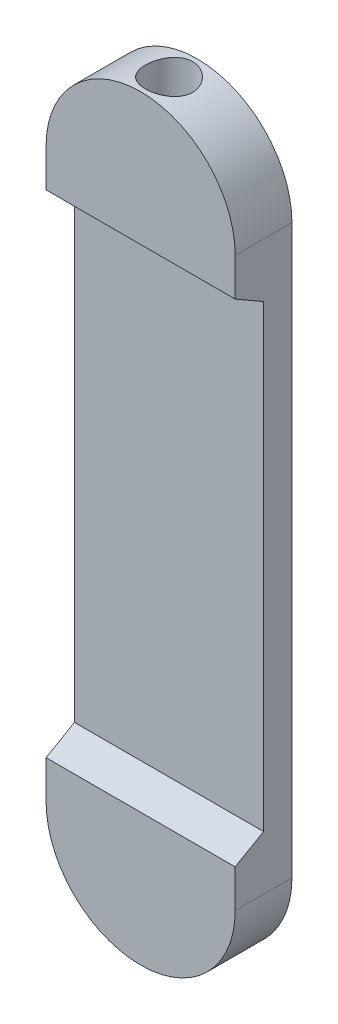
ISO-10303-21;
HEADER;
FILE_DESCRIPTION(('STEP AP214'),'2;1');
FILE_NAME('part.step','',(''),(''),'','','');
FILE_SCHEMA(('AUTOMOTIVE_DESIGN { 1 0 10303 214 1 1 1 1 }'));
ENDSEC;
DATA;
#1=APPLICATION_CONTEXT('core data for automotive mechanical design processes');
#2=APPLICATION_PROTOCOL_DEFINITION('international standard','automotive_design',2000,#1);
#3=PRODUCT_CONTEXT('',#1,'mechanical');
#4=PRODUCT('Part','Part','',(#3));
#5=PRODUCT_RELATED_PRODUCT_CATEGORY('part','',(#4));
#6=PRODUCT_DEFINITION_FORMATION('','',#4);
#7=PRODUCT_DEFINITION_CONTEXT('part definition',#1,'design');
#8=PRODUCT_DEFINITION('design','',#6,#7);
#9=PRODUCT_DEFINITION_SHAPE('','',#8);
#10=(LENGTH_UNIT() NAMED_UNIT(*) SI_UNIT(.MILLI.,.METRE.));
#11=(NAMED_UNIT(*) PLANE_ANGLE_UNIT() SI_UNIT($,.RADIAN.));
#12=(NAMED_UNIT(*) SI_UNIT($,.STERADIAN.) SOLID_ANGLE_UNIT());
#13=UNCERTAINTY_MEASURE_WITH_UNIT(LENGTH_MEASURE(1.E-05),#10,'distance_accuracy_value','');
#14=(GEOMETRIC_REPRESENTATION_CONTEXT(3) GLOBAL_UNCERTAINTY_ASSIGNED_CONTEXT((#13)) GLOBAL_UNIT_ASSIGNED_CONTEXT((#10,
#11,#12)) REPRESENTATION_CONTEXT('',''));
#15=CARTESIAN_POINT('',(0.,0.,0.));
#16=DIRECTION('',(0.,0.,1.));
#17=DIRECTION('',(1.,0.,0.));
#18=AXIS2_PLACEMENT_3D('',#15,#16,#17);
#19=CARTESIAN_POINT('',(0.,150.,15.));
#20=DIRECTION('',(0.,0.,1.));
#21=DIRECTION('',(1.,0.,0.));
#22=AXIS2_PLACEMENT_3D('',#19,#20,#21);
#23=PLANE('',#22);
#24=DIRECTION('',(-1.,0.,0.));
#25=VECTOR('',#24,1.);
#26=CARTESIAN_POINT('',(0.,130.,15.));
#27=LINE('',#26,#25);
#28=CARTESIAN_POINT('',(50.,130.,15.));
#29=VERTEX_POINT('',#28);
#30=CARTESIAN_POINT('',(-50.,130.,15.));
#31=VERTEX_POINT('',#30);
#32=EDGE_CURVE('E11',#29,#31,#27,.T.);
#33=ORIENTED_EDGE('',*,*,#32,.F.);
#34=DIRECTION('',(0.,1.,0.));
#35=VECTOR('',#34,1.);
#36=CARTESIAN_POINT('',(50.,-150.,15.));
#37=LINE('',#36,#35);
#38=CARTESIAN_POINT('',(50.,150.,15.));
#39=VERTEX_POINT('',#38);
#40=EDGE_CURVE('E77',#29,#39,#37,.T.);
#41=ORIENTED_EDGE('',*,*,#40,.T.);
#42=CARTESIAN_POINT('',(0.,150.,15.));
#43=DIRECTION('',(0.,0.,1.));
#44=DIRECTION('',(1.,0.,0.));
#45=AXIS2_PLACEMENT_3D('',#42,#43,#44);
#46=CIRCLE('',#45,50.);
#47=CARTESIAN_POINT('',(-50.,150.,15.));
#48=VERTEX_POINT('',#47);
#49=EDGE_CURVE('E172',#39,#48,#46,.T.);
#50=ORIENTED_EDGE('',*,*,#49,.T.);
#51=DIRECTION('',(0.,-1.,0.));
#52=VECTOR('',#51,1.);
#53=CARTESIAN_POINT('',(-50.,-150.,15.));
#54=LINE('',#53,#52);
#55=EDGE_CURVE('E107',#48,#31,#54,.T.);
#56=ORIENTED_EDGE('',*,*,#55,.T.);
#57=EDGE_LOOP('',(#33,#41,#50,#56));
#58=FACE_BOUND('',#57,.T.);
#59=ADVANCED_FACE('F45',(#58),#23,.T.);
#60=CARTESIAN_POINT('',(0.,150.,15.));
#61=DIRECTION('',(0.,0.,-1.));
#62=DIRECTION('',(-1.,0.,0.));
#63=AXIS2_PLACEMENT_3D('',#60,#61,#62);
#64=CYLINDRICAL_SURFACE('',#63,50.);
#65=CARTESIAN_POINT('',(0.,150.,-15.));
#66=DIRECTION('',(0.,0.,1.));
#67=DIRECTION('',(1.,0.,0.));
#68=AXIS2_PLACEMENT_3D('',#65,#66,#67);
#69=CIRCLE('',#68,50.);
#70=CARTESIAN_POINT('',(50.,150.,-15.));
#71=VERTEX_POINT('',#70);
#72=CARTESIAN_POINT('',(-50.,150.,-15.));
#73=VERTEX_POINT('',#72);
#74=EDGE_CURVE('E160',#71,#73,#69,.T.);
#75=ORIENTED_EDGE('',*,*,#74,.T.);
#76=DIRECTION('',(0.,0.,-1.));
#77=VECTOR('',#76,1.);
#78=CARTESIAN_POINT('',(-50.,150.,15.));
#79=LINE('',#78,#77);
#80=EDGE_CURVE('E136',#48,#73,#79,.T.);
#81=ORIENTED_EDGE('',*,*,#80,.F.);
#82=ORIENTED_EDGE('',*,*,#49,.F.);
#83=DIRECTION('',(0.,0.,-1.));
#84=VECTOR('',#83,1.);
#85=CARTESIAN_POINT('',(50.,150.,15.));
#86=LINE('',#85,#84);
#87=EDGE_CURVE('E151',#39,#71,#86,.T.);
#88=ORIENTED_EDGE('',*,*,#87,.T.);
#89=EDGE_LOOP('',(#75,#81,#82,#88));
#90=FACE_BOUND('',#89,.T.);
#91=CARTESIAN_POINT('',(0.,200.,-12.5));
#92=CARTESIAN_POINT('',(-0.345345858129955,199.999999184285,-12.499998542476));
#93=CARTESIAN_POINT('',(-0.690720980627794,199.996413178085,-12.4856762712683));
#94=CARTESIAN_POINT('',(-1.37897685436808,199.982166282124,-12.4285034438653));
#95=CARTESIAN_POINT('',(-1.7218573165034,199.971504585157,-12.3856496327458));
#96=CARTESIAN_POINT('',(-2.40280021913144,199.943395206291,-12.2717468283778));
#97=CARTESIAN_POINT('',(-2.74086012527902,199.925944082084,-12.2006835322718));
#98=CARTESIAN_POINT('',(-3.40956959119171,199.884737782645,-12.0309531087511));
#99=CARTESIAN_POINT('',(-3.74021934014551,199.860982768556,-11.932286686941));
#100=CARTESIAN_POINT('',(-4.39143160454447,199.807850138443,-11.7082770348339));
#101=CARTESIAN_POINT('',(-4.71200589293533,199.778479392052,-11.5829663772143));
#102=CARTESIAN_POINT('',(-5.34133409076771,199.714889005911,-11.3065586325392));
#103=CARTESIAN_POINT('',(-5.65008793760106,199.680669340483,-11.1554614089257));
#104=CARTESIAN_POINT('',(-6.25375145648697,199.608295845489,-10.8285920771972));
#105=CARTESIAN_POINT('',(-6.54866132890482,199.570142072887,-10.6528203263462));
#106=CARTESIAN_POINT('',(-7.1227706440562,199.49090954588,-10.2778258129714));
#107=CARTESIAN_POINT('',(-7.40196939376919,199.449830662629,-10.0786020171701));
#108=CARTESIAN_POINT('',(-7.94789184610699,199.365055796241,-9.65415754429416));
#109=CARTESIAN_POINT('',(-8.21428968409248,199.321325479097,-9.42852450106898));
#110=CARTESIAN_POINT('',(-8.7272289784513,199.23315156486,-8.95584237426211));
#111=CARTESIAN_POINT('',(-8.97377020011485,199.188707959344,-8.70879303760656));
#112=CARTESIAN_POINT('',(-9.44541093088348,199.100323812197,-8.19486829551773));
#113=CARTESIAN_POINT('',(-9.67050778077715,199.056383333549,-7.92799043853143));
#114=CARTESIAN_POINT('',(-10.097711498905,198.970232983262,-7.37617587363528));
#115=CARTESIAN_POINT('',(-10.2998189613326,198.928023066912,-7.09123963276649));
#116=CARTESIAN_POINT('',(-10.6824846765056,198.845914886664,-6.50077864948295));
#117=CARTESIAN_POINT('',(-10.8626766877929,198.806060474744,-6.19501027061268));
#118=CARTESIAN_POINT('',(-11.1965999199108,198.730539402161,-5.56884605054303));
#119=CARTESIAN_POINT('',(-11.3503308067052,198.694872794366,-5.24845002475386));
#120=CARTESIAN_POINT('',(-11.6301059024363,198.628811520673,-4.59530579606809));
#121=CARTESIAN_POINT('',(-11.7561535554537,198.598416199073,-4.26255913574648));
#122=CARTESIAN_POINT('',(-11.9795435842076,198.543833524198,-3.58707023733103));
#123=CARTESIAN_POINT('',(-12.0768866475326,198.519646022224,-3.24432823888126));
#124=CARTESIAN_POINT('',(-12.2403753433022,198.478656911185,-2.55832805448346));
#125=CARTESIAN_POINT('',(-12.3071067781999,198.461717073307,-2.21521770157624));
#126=CARTESIAN_POINT('',(-12.4116255097281,198.435054152996,-1.52433762999712));
#127=CARTESIAN_POINT('',(-12.4494131572523,198.425330983075,-1.17656796786334));
#128=CARTESIAN_POINT('',(-12.4957081162939,198.413405711739,-0.479005845104437));
#129=CARTESIAN_POINT('',(-12.5042195850568,198.411202542477,-0.129213678743619));
#130=CARTESIAN_POINT('',(-12.4918975051369,198.414383592704,0.56981600901988));
#131=CARTESIAN_POINT('',(-12.4710643644883,198.419767706692,0.919053538067147));
#132=CARTESIAN_POINT('',(-12.4011011342675,198.437732699288,1.60591279143432));
#133=CARTESIAN_POINT('',(-12.3526702834176,198.45013569001,1.94361068244322));
#134=CARTESIAN_POINT('',(-12.2284550484748,198.481635558749,2.61361187278367));
#135=CARTESIAN_POINT('',(-12.1526711732496,198.500732312238,2.94591527235263));
#136=CARTESIAN_POINT('',(-11.9743582368255,198.545063330048,3.60285956314226));
#137=CARTESIAN_POINT('',(-11.8718278701608,198.570297893945,3.92750007950268));
#138=CARTESIAN_POINT('',(-11.6408201249125,198.62618035636,4.56693246540194));
#139=CARTESIAN_POINT('',(-11.5123423376766,198.656828340134,4.8817241797394));
#140=CARTESIAN_POINT('',(-11.2289731703879,198.723008232122,5.50252257587502));
#141=CARTESIAN_POINT('',(-11.0738287052328,198.75858623661,5.80840878938925));
#142=CARTESIAN_POINT('',(-10.7391618403495,198.833388041298,6.4060680089994));
#143=CARTESIAN_POINT('',(-10.5596393506019,198.872611854959,6.69784096297475));
#144=CARTESIAN_POINT('',(-10.1774241513362,198.953633076933,7.26547516607328));
#145=CARTESIAN_POINT('',(-9.97472805748094,198.995430860742,7.54133408219258));
#146=CARTESIAN_POINT('',(-9.54752439698663,199.080466581578,8.07537681044579));
#147=CARTESIAN_POINT('',(-9.32301640852999,199.123704546445,8.33356028059175));
#148=CARTESIAN_POINT('',(-8.84692110492471,199.211708281983,8.83773744641804));
#149=CARTESIAN_POINT('',(-8.59474378950227,199.256482435885,9.08317289987926));
#150=CARTESIAN_POINT('',(-8.07050421758106,199.345087069182,9.551995703129));
#151=CARTESIAN_POINT('',(-7.79844157272413,199.388917530125,9.77538262211187));
#152=CARTESIAN_POINT('',(-7.23621606208977,199.474417786311,10.1985771706933));
#153=CARTESIAN_POINT('',(-6.94605248845918,199.51608749694,10.3983838772818));
#154=CARTESIAN_POINT('',(-6.34956444270317,199.596104338477,10.772978157784));
#155=CARTESIAN_POINT('',(-6.04324006914541,199.634451489647,10.947765884269));
#156=CARTESIAN_POINT('',(-5.41541235056755,199.706875689934,11.2715789798304));
#157=CARTESIAN_POINT('',(-5.09386005140018,199.740937469953,11.4205129077416));
#158=CARTESIAN_POINT('',(-4.43881192206135,199.803666427227,11.6907000644577));
#159=CARTESIAN_POINT('',(-4.10531602480211,199.832333574175,11.8119531377496));
#160=CARTESIAN_POINT('',(-3.42883552948264,199.883445320008,12.0257598474396));
#161=CARTESIAN_POINT('',(-3.08585241729649,199.905890887307,12.1183179505915));
#162=CARTESIAN_POINT('',(-2.39289058593558,199.943913194151,12.2739631052046));
#163=CARTESIAN_POINT('',(-2.04291203945214,199.959490103039,12.3370508832442));
#164=CARTESIAN_POINT('',(-1.34763092374324,199.983014865086,12.4319680906689));
#165=CARTESIAN_POINT('',(-1.00243806174491,199.991147839537,12.4645564950301));
#166=CARTESIAN_POINT('',(-0.310446227793136,200.000233463267,12.5009464008154));
#167=CARTESIAN_POINT('',(0.0363527166592404,200.001186235042,12.5047483933412));
#168=CARTESIAN_POINT('',(0.728982210807774,199.995885034322,12.4835341096494));
#169=CARTESIAN_POINT('',(1.07481283841245,199.989631659355,12.458520222818));
#170=CARTESIAN_POINT('',(1.76300446713083,199.970094195313,12.3798934330572));
#171=CARTESIAN_POINT('',(2.10536548180506,199.956810133729,12.3262806419468));
#172=CARTESIAN_POINT('',(2.77909750176338,199.923828862721,12.1919176524651));
#173=CARTESIAN_POINT('',(3.11055621416769,199.90422984941,12.1115824000743));
#174=CARTESIAN_POINT('',(3.76542622915844,199.859094400732,11.9242422256603));
#175=CARTESIAN_POINT('',(4.08883763558724,199.833558042024,11.8172376479743));
#176=CARTESIAN_POINT('',(4.72547495684811,199.777223972746,11.5773748413572));
#177=CARTESIAN_POINT('',(5.03870011901851,199.746425874434,11.4445147070017));
#178=CARTESIAN_POINT('',(5.65290579173548,199.680379178579,11.1539268996522));
#179=CARTESIAN_POINT('',(5.95388607609178,199.645130498873,10.996198767553));
#180=CARTESIAN_POINT('',(6.54690733138469,199.57044384345,10.6539790694276));
#181=CARTESIAN_POINT('',(6.83869503605042,199.530942648331,10.4690623992547));
#182=CARTESIAN_POINT('',(7.40573208883361,199.449339710756,10.075919856371));
#183=CARTESIAN_POINT('',(7.68098127638992,199.407237943061,9.86769375742107));
#184=CARTESIAN_POINT('',(8.21323439402229,199.321551719819,9.42929844928364));
#185=CARTESIAN_POINT('',(8.47023554350212,199.277967039799,9.19912590841093));
#186=CARTESIAN_POINT('',(8.96431645792167,199.190486774203,8.71836265750537));
#187=CARTESIAN_POINT('',(9.20139599740279,199.146591185113,8.46777171645481));
#188=CARTESIAN_POINT('',(9.65967669367524,199.058602006003,7.94137233363743));
#189=CARTESIAN_POINT('',(9.8803443006733,199.014530071314,7.66509543686493));
#190=CARTESIAN_POINT('',(10.2976362133889,198.928561070308,7.09461670037542));
#191=CARTESIAN_POINT('',(10.494260080341,198.886664043689,6.8004145336935));
#192=CARTESIAN_POINT('',(10.8620404955946,198.806265209162,6.19606290103677));
#193=CARTESIAN_POINT('',(11.0331976403887,198.76776332174,5.88591380880689));
#194=CARTESIAN_POINT('',(11.3487546890229,198.69529742399,5.25177939598629));
#195=CARTESIAN_POINT('',(11.493154965098,198.661333350535,4.92779426795627));
#196=CARTESIAN_POINT('',(11.7532704940522,198.599160704575,4.27023312528235));
#197=CARTESIAN_POINT('',(11.8691526557657,198.570918822345,3.93672631797506));
#198=CARTESIAN_POINT('',(12.0723939041458,198.520802494786,3.26065850705787));
#199=CARTESIAN_POINT('',(12.1597530307871,198.498928040534,2.91809751613803));
#200=CARTESIAN_POINT('',(12.3051825749983,198.462233904861,2.22650410200566));
#201=CARTESIAN_POINT('',(12.363258366872,198.44741292896,1.87747287845977));
#202=CARTESIAN_POINT('',(12.4496272042819,198.425290706484,1.17551084786422));
#203=CARTESIAN_POINT('',(12.4779209663603,198.417989278992,0.822580134840997));
#204=CARTESIAN_POINT('',(12.5040902755747,198.411237274818,0.125690563470849));
#205=CARTESIAN_POINT('',(12.5028170258756,198.411567004214,-0.218234490431433));
#206=CARTESIAN_POINT('',(12.4719496530419,198.419528359508,-0.904721133720526));
#207=CARTESIAN_POINT('',(12.4423561029709,198.427159837655,-1.24728275055576));
#208=CARTESIAN_POINT('',(12.3551031042829,198.449493783664,-1.92856624844878));
#209=CARTESIAN_POINT('',(12.2974444019395,198.464196063509,-2.26728823136027));
#210=CARTESIAN_POINT('',(12.1545443869924,198.500231662698,-2.93850126361318));
#211=CARTESIAN_POINT('',(12.0693029361175,198.521565015284,-3.27099228171019));
#212=CARTESIAN_POINT('',(11.872520891633,198.570087933544,-3.92547045749319));
#213=CARTESIAN_POINT('',(11.7611408263901,198.597241668922,-4.24750858869968));
#214=CARTESIAN_POINT('',(11.512668480082,198.656703240108,-4.88100719240879));
#215=CARTESIAN_POINT('',(11.3755763832328,198.689011038988,-5.19246774067647));
#216=CARTESIAN_POINT('',(11.0766699521319,198.75788031468,-5.80283282354661));
#217=CARTESIAN_POINT('',(10.9148532284252,198.794442202535,-6.10173614102079));
#218=CARTESIAN_POINT('',(10.5676324058471,198.870816774177,-6.6850856288295));
#219=CARTESIAN_POINT('',(10.3822273342624,198.910629591997,-6.96953120229243));
#220=CARTESIAN_POINT('',(9.98393796386294,198.993503812733,-7.52941321165711));
#221=CARTESIAN_POINT('',(9.77046302819968,199.036622864994,-7.80442110523205));
#222=CARTESIAN_POINT('',(9.32142482529095,199.123958929279,-8.33558565405774));
#223=CARTESIAN_POINT('',(9.08586116383034,199.168175960887,-8.59174197272077));
#224=CARTESIAN_POINT('',(8.59419030433725,199.256494625742,-9.08354529744731));
#225=CARTESIAN_POINT('',(8.33808285097161,199.300596257546,-9.31919204852711));
#226=CARTESIAN_POINT('',(7.80686919956303,199.387500913739,-9.76851402919657));
#227=CARTESIAN_POINT('',(7.53175479311294,199.430303365428,-9.98217966554262));
#228=CARTESIAN_POINT('',(6.95924298273734,199.514181118891,-10.3896396759224));
#229=CARTESIAN_POINT('',(6.66153155922842,199.55521091619,-10.5830025235865));
#230=CARTESIAN_POINT('',(6.0505082327496,199.633518505882,-10.943818987176));
#231=CARTESIAN_POINT('',(5.73720336100236,199.67079796683,-11.1112841431721));
#232=CARTESIAN_POINT('',(5.09716652663357,199.740551632484,-11.4190604869767));
#233=CARTESIAN_POINT('',(4.77043989044131,199.773027720314,-11.5593823227875));
#234=CARTESIAN_POINT('',(4.10578919609509,199.832256061333,-11.8118084302427));
#235=CARTESIAN_POINT('',(3.76786683581591,199.859009177884,-11.9239169585779));
#236=CARTESIAN_POINT('',(3.14787089764562,199.901587879739,-12.1005925818354));
#237=CARTESIAN_POINT('',(2.86728001520346,199.918522742067,-12.1701379933195));
#238=CARTESIAN_POINT('',(2.3017294789982,199.947794606943,-12.2896522930125));
#239=CARTESIAN_POINT('',(2.01677013144287,199.960131930235,-12.339622546882));
#240=CARTESIAN_POINT('',(1.44387788843724,199.979969707119,-12.4196972192842));
#241=CARTESIAN_POINT('',(1.15594470933018,199.987469694893,-12.4497997246361));
#242=CARTESIAN_POINT('',(0.578680949140913,199.997484542333,-12.4899491478882));
#243=CARTESIAN_POINT('',(0.289350746448697,200.000000683453,-12.500001221198));
#244=CARTESIAN_POINT('',(0.,200.,-12.5));
#245=B_SPLINE_CURVE_WITH_KNOTS('',3,(#91,#92,#93,#94,#95,#96,#97,#98,#99,#100,#101,#102,#103,
#104,#105,#106,#107,#108,#109,#110,#111,#112,#113,#114,#115,#116,#117,#118,#119,#120,#121,#122,
#123,#124,#125,#126,#127,#128,#129,#130,#131,#132,#133,#134,#135,#136,#137,#138,#139,#140,#141,
#142,#143,#144,#145,#146,#147,#148,#149,#150,#151,#152,#153,#154,#155,#156,#157,#158,#159,#160,
#161,#162,#163,#164,#165,#166,#167,#168,#169,#170,#171,#172,#173,#174,#175,#176,#177,#178,#179,
#180,#181,#182,#183,#184,#185,#186,#187,#188,#189,#190,#191,#192,#193,#194,#195,#196,#197,#198,
#199,#200,#201,#202,#203,#204,#205,#206,#207,#208,#209,#210,#211,#212,#213,#214,#215,#216,#217,
#218,#219,#220,#221,#222,#223,#224,#225,#226,#227,#228,#229,#230,#231,#232,#233,#234,#235,#236,
#237,#238,#239,#240,#241,#242,#243,#244),.UNSPECIFIED.,.T.,.F.,(4,2,2,2,2,2,2,2,2,2,2,2,2,2,2,2,
2,2,2,2,2,2,2,2,2,2,2,2,2,2,2,2,2,2,2,2,2,2,2,2,2,2,2,2,2,2,2,2,2,2,2,2,2,2,2,2,2,2,2,2,2,2,2,2,
2,2,2,2,2,2,2,2,2,2,2,2,4),(0.,1.03577386168253,2.0716659063673,3.10808384435616,
4.1444752913513,5.17960695669381,6.21474410395866,7.24986626495346,8.2850340496454,
9.3393306674218,10.3936397453979,11.4480793933577,12.5024917816352,13.5726259410068,
14.6427736083933,15.7127880628206,16.7827768840836,17.8313349253048,18.879880254364,
19.928276682827,20.97665853357,21.9995889895184,23.0225004161404,24.0454617792483,
25.0684392544812,26.1017236302133,27.1350118215961,28.1684511104691,29.2019103888785,
30.2648664166191,31.3278432093162,32.3908615967694,33.4538735014281,34.520571739592,
35.5872759703926,36.6538140710205,37.7203258752158,38.7595309263662,39.7987182484387,
40.8378194082581,41.8769165053203,42.9005782126277,43.9242267037567,44.9479506612139,
45.9716935205623,47.0135955987419,48.0555077904033,49.0975784071608,50.1396608157438,
51.2073584154887,52.2750754963473,53.3427675647283,54.4104447785245,55.4717160437128,
56.5329858215357,57.5940607559717,58.6551101608368,59.6856519612318,60.7161729089662,
61.7466664558696,62.7771651686731,63.8014935316577,64.8258145560391,65.8502346362694,
66.8746969742307,67.9258821743524,68.9770861384359,70.0283031696703,71.0799770556584,
72.1507569661663,73.2210583512334,74.2909390144763,75.3606581622632,76.22868967188,
77.0966606124975,77.9647151228769,78.8325464084547),.UNSPECIFIED.);
#246=CARTESIAN_POINT('',(0.,200.,-12.5));
#247=VERTEX_POINT('',#246);
#248=EDGE_CURVE('E165',#247,#247,#245,.T.);
#249=ORIENTED_EDGE('',*,*,#248,.F.);
#250=EDGE_LOOP('',(#249));
#251=FACE_BOUND('',#250,.T.);
#252=ADVANCED_FACE('F47',(#90,#251),#64,.T.);
#253=CARTESIAN_POINT('',(-50.,-150.,15.));
#254=DIRECTION('',(1.,0.,0.));
#255=DIRECTION('',(0.,0.,-1.));
#256=AXIS2_PLACEMENT_3D('',#253,#254,#255);
#257=PLANE('',#256);
#258=DIRECTION('',(0.,1.,0.));
#259=VECTOR('',#258,1.);
#260=CARTESIAN_POINT('',(-50.,-150.,0.));
#261=LINE('',#260,#259);
#262=CARTESIAN_POINT('',(-50.,-121.339745962156,0.));
#263=VERTEX_POINT('',#262);
#264=CARTESIAN_POINT('',(-50.,121.339745962156,0.));
#265=VERTEX_POINT('',#264);
#266=EDGE_CURVE('E235',#263,#265,#261,.T.);
#267=ORIENTED_EDGE('',*,*,#266,.T.);
#268=DIRECTION('',(0.,0.499999999999998,0.86602540378444));
#269=VECTOR('',#268,1.);
#270=CARTESIAN_POINT('',(-50.,60.0000000000007,-106.243556529821));
#271=LINE('',#270,#269);
#272=EDGE_CURVE('E238',#265,#31,#271,.T.);
#273=ORIENTED_EDGE('',*,*,#272,.T.);
#274=ORIENTED_EDGE('',*,*,#55,.F.);
#275=ORIENTED_EDGE('',*,*,#80,.T.);
#276=DIRECTION('',(0.,-1.,0.));
#277=VECTOR('',#276,1.);
#278=CARTESIAN_POINT('',(-50.,-150.,-15.));
#279=LINE('',#278,#277);
#280=CARTESIAN_POINT('',(-50.,-150.,-15.));
#281=VERTEX_POINT('',#280);
#282=EDGE_CURVE('E164',#73,#281,#279,.T.);
#283=ORIENTED_EDGE('',*,*,#282,.T.);
#284=DIRECTION('',(0.,0.,-1.));
#285=VECTOR('',#284,1.);
#286=CARTESIAN_POINT('',(-50.,-150.,15.));
#287=LINE('',#286,#285);
#288=CARTESIAN_POINT('',(-50.,-150.,15.));
#289=VERTEX_POINT('',#288);
#290=EDGE_CURVE('E176',#289,#281,#287,.T.);
#291=ORIENTED_EDGE('',*,*,#290,.F.);
#292=CARTESIAN_POINT('',(-50.,-130.,15.));
#293=VERTEX_POINT('',#292);
#294=EDGE_CURVE('E226',#293,#289,#54,.T.);
#295=ORIENTED_EDGE('',*,*,#294,.F.);
#296=DIRECTION('',(0.,0.499999999999998,-0.86602540378444));
#297=VECTOR('',#296,1.);
#298=CARTESIAN_POINT('',(-50.,-135.,23.6602540378444));
#299=LINE('',#298,#297);
#300=EDGE_CURVE('E68',#293,#263,#299,.T.);
#301=ORIENTED_EDGE('',*,*,#300,.T.);
#302=EDGE_LOOP('',(#267,#273,#274,#275,#283,#291,#295,#301));
#303=FACE_BOUND('',#302,.T.);
#304=ADVANCED_FACE('F207',(#303),#257,.F.);
#305=CARTESIAN_POINT('',(0.,-150.,15.));
#306=DIRECTION('',(0.,0.,-1.));
#307=DIRECTION('',(-1.,0.,0.));
#308=AXIS2_PLACEMENT_3D('',#305,#306,#307);
#309=CYLINDRICAL_SURFACE('',#308,50.);
#310=CARTESIAN_POINT('',(0.,-200.,12.5));
#311=CARTESIAN_POINT('',(0.345345858129954,-199.999999184285,12.499998542476));
#312=CARTESIAN_POINT('',(0.690720980627793,-199.996413178085,12.4856762712683));
#313=CARTESIAN_POINT('',(1.37897685436808,-199.982166282124,12.4285034438653));
#314=CARTESIAN_POINT('',(1.7218573165034,-199.971504585157,12.3856496327458));
#315=CARTESIAN_POINT('',(2.40280021913144,-199.943395206291,12.2717468283778));
#316=CARTESIAN_POINT('',(2.74086012527902,-199.925944082084,12.2006835322718));
#317=CARTESIAN_POINT('',(3.40956959119171,-199.884737782645,12.0309531087511));
#318=CARTESIAN_POINT('',(3.74021934014551,-199.860982768556,11.932286686941));
#319=CARTESIAN_POINT('',(4.39143160454447,-199.807850138443,11.7082770348339));
#320=CARTESIAN_POINT('',(4.71200589293533,-199.778479392052,11.5829663772143));
#321=CARTESIAN_POINT('',(5.34133409076771,-199.714889005911,11.3065586325392));
#322=CARTESIAN_POINT('',(5.65008793760106,-199.680669340483,11.1554614089257));
#323=CARTESIAN_POINT('',(6.25375145648697,-199.608295845489,10.8285920771972));
#324=CARTESIAN_POINT('',(6.54866132890482,-199.570142072887,10.6528203263462));
#325=CARTESIAN_POINT('',(7.1227706440562,-199.49090954588,10.2778258129714));
#326=CARTESIAN_POINT('',(7.40196939376919,-199.449830662629,10.0786020171701));
#327=CARTESIAN_POINT('',(7.94789184610699,-199.365055796241,9.65415754429416));
#328=CARTESIAN_POINT('',(8.21428968409248,-199.321325479097,9.42852450106898));
#329=CARTESIAN_POINT('',(8.7272289784513,-199.23315156486,8.95584237426211));
#330=CARTESIAN_POINT('',(8.97377020011485,-199.188707959344,8.70879303760655));
#331=CARTESIAN_POINT('',(9.44541093088348,-199.100323812197,8.19486829551772));
#332=CARTESIAN_POINT('',(9.67050778077715,-199.056383333549,7.92799043853142));
#333=CARTESIAN_POINT('',(10.097711498905,-198.970232983262,7.37617587363527));
#334=CARTESIAN_POINT('',(10.2998189613326,-198.928023066912,7.09123963276649));
#335=CARTESIAN_POINT('',(10.6824846765056,-198.845914886664,6.50077864948295));
#336=CARTESIAN_POINT('',(10.8626766877929,-198.806060474744,6.19501027061268));
#337=CARTESIAN_POINT('',(11.1965999199108,-198.730539402161,5.56884605054303));
#338=CARTESIAN_POINT('',(11.3503308067053,-198.694872794366,5.24845002475386));
#339=CARTESIAN_POINT('',(11.6301059024363,-198.628811520673,4.59530579606809));
#340=CARTESIAN_POINT('',(11.7561535554537,-198.598416199073,4.26255913574648));
#341=CARTESIAN_POINT('',(11.9795435842076,-198.543833524198,3.58707023733103));
#342=CARTESIAN_POINT('',(12.0768866475326,-198.519646022224,3.24432823888125));
#343=CARTESIAN_POINT('',(12.2403753433022,-198.478656911185,2.55832805448346));
#344=CARTESIAN_POINT('',(12.3071067781999,-198.461717073307,2.21521770157624));
#345=CARTESIAN_POINT('',(12.4116255097281,-198.435054152996,1.52433762999712));
#346=CARTESIAN_POINT('',(12.4494131572523,-198.425330983075,1.17656796786334));
#347=CARTESIAN_POINT('',(12.4957081162939,-198.413405711739,0.479005845104437));
#348=CARTESIAN_POINT('',(12.5042195850568,-198.411202542477,0.129213678743619));
#349=CARTESIAN_POINT('',(12.4918975051369,-198.414383592704,-0.56981600901988));
#350=CARTESIAN_POINT('',(12.4710643644883,-198.419767706692,-0.919053538067148));
#351=CARTESIAN_POINT('',(12.4011011342675,-198.437732699288,-1.60591279143433));
#352=CARTESIAN_POINT('',(12.3526702834176,-198.45013569001,-1.94361068244322));
#353=CARTESIAN_POINT('',(12.2284550484748,-198.481635558749,-2.61361187278367));
#354=CARTESIAN_POINT('',(12.1526711732496,-198.500732312238,-2.94591527235263));
#355=CARTESIAN_POINT('',(11.9743582368255,-198.545063330048,-3.60285956314227));
#356=CARTESIAN_POINT('',(11.8718278701608,-198.570297893945,-3.92750007950269));
#357=CARTESIAN_POINT('',(11.6408201249125,-198.62618035636,-4.56693246540194));
#358=CARTESIAN_POINT('',(11.5123423376766,-198.656828340134,-4.8817241797394));
#359=CARTESIAN_POINT('',(11.2289731703879,-198.723008232122,-5.50252257587503));
#360=CARTESIAN_POINT('',(11.0738287052328,-198.75858623661,-5.80840878938926));
#361=CARTESIAN_POINT('',(10.7391618403495,-198.833388041298,-6.40606800899941));
#362=CARTESIAN_POINT('',(10.5596393506019,-198.872611854959,-6.69784096297475));
#363=CARTESIAN_POINT('',(10.1774241513362,-198.953633076933,-7.26547516607329));
#364=CARTESIAN_POINT('',(9.97472805748094,-198.995430860742,-7.54133408219258));
#365=CARTESIAN_POINT('',(9.54752439698663,-199.080466581578,-8.07537681044579));
#366=CARTESIAN_POINT('',(9.32301640852998,-199.123704546445,-8.33356028059175));
#367=CARTESIAN_POINT('',(8.84692110492471,-199.211708281983,-8.83773744641804));
#368=CARTESIAN_POINT('',(8.59474378950227,-199.256482435885,-9.08317289987926));
#369=CARTESIAN_POINT('',(8.07050421758106,-199.345087069182,-9.551995703129));
#370=CARTESIAN_POINT('',(7.79844157272413,-199.388917530125,-9.77538262211187));
#371=CARTESIAN_POINT('',(7.23621606208977,-199.474417786311,-10.1985771706933));
#372=CARTESIAN_POINT('',(6.94605248845919,-199.51608749694,-10.3983838772818));
#373=CARTESIAN_POINT('',(6.34956444270317,-199.596104338477,-10.772978157784));
#374=CARTESIAN_POINT('',(6.04324006914541,-199.634451489647,-10.947765884269));
#375=CARTESIAN_POINT('',(5.41541235056755,-199.706875689934,-11.2715789798304));
#376=CARTESIAN_POINT('',(5.09386005140018,-199.740937469953,-11.4205129077416));
#377=CARTESIAN_POINT('',(4.43881192206135,-199.803666427227,-11.6907000644577));
#378=CARTESIAN_POINT('',(4.10531602480211,-199.832333574175,-11.8119531377496));
#379=CARTESIAN_POINT('',(3.42883552948264,-199.883445320008,-12.0257598474396));
#380=CARTESIAN_POINT('',(3.08585241729649,-199.905890887307,-12.1183179505915));
#381=CARTESIAN_POINT('',(2.39289058593557,-199.943913194151,-12.2739631052046));
#382=CARTESIAN_POINT('',(2.04291203945214,-199.959490103039,-12.3370508832442));
#383=CARTESIAN_POINT('',(1.34763092374324,-199.983014865086,-12.4319680906689));
#384=CARTESIAN_POINT('',(1.00243806174491,-199.991147839537,-12.4645564950301));
#385=CARTESIAN_POINT('',(0.310446227793134,-200.000233463267,-12.5009464008154));
#386=CARTESIAN_POINT('',(-0.0363527166592434,-200.001186235042,-12.5047483933412));
#387=CARTESIAN_POINT('',(-0.728982210807777,-199.995885034322,-12.4835341096494));
#388=CARTESIAN_POINT('',(-1.07481283841246,-199.989631659355,-12.458520222818));
#389=CARTESIAN_POINT('',(-1.76300446713084,-199.970094195313,-12.3798934330572));
#390=CARTESIAN_POINT('',(-2.10536548180507,-199.956810133729,-12.3262806419468));
#391=CARTESIAN_POINT('',(-2.77909750176338,-199.923828862721,-12.1919176524651));
#392=CARTESIAN_POINT('',(-3.11055621416769,-199.90422984941,-12.1115824000743));
#393=CARTESIAN_POINT('',(-3.76542622915844,-199.859094400732,-11.9242422256603));
#394=CARTESIAN_POINT('',(-4.08883763558724,-199.833558042024,-11.8172376479743));
#395=CARTESIAN_POINT('',(-4.72547495684811,-199.777223972746,-11.5773748413572));
#396=CARTESIAN_POINT('',(-5.03870011901852,-199.746425874434,-11.4445147070017));
#397=CARTESIAN_POINT('',(-5.65290579173548,-199.680379178579,-11.1539268996522));
#398=CARTESIAN_POINT('',(-5.95388607609178,-199.645130498873,-10.996198767553));
#399=CARTESIAN_POINT('',(-6.54690733138469,-199.57044384345,-10.6539790694276));
#400=CARTESIAN_POINT('',(-6.83869503605042,-199.530942648331,-10.4690623992547));
#401=CARTESIAN_POINT('',(-7.40573208883362,-199.449339710756,-10.075919856371));
#402=CARTESIAN_POINT('',(-7.68098127638992,-199.407237943061,-9.86769375742107));
#403=CARTESIAN_POINT('',(-8.21323439402229,-199.321551719819,-9.42929844928364));
#404=CARTESIAN_POINT('',(-8.47023554350212,-199.277967039799,-9.19912590841092));
#405=CARTESIAN_POINT('',(-8.96431645792168,-199.190486774203,-8.71836265750537));
#406=CARTESIAN_POINT('',(-9.2013959974028,-199.146591185113,-8.46777171645481));
#407=CARTESIAN_POINT('',(-9.65967669367525,-199.058602006003,-7.94137233363743));
#408=CARTESIAN_POINT('',(-9.8803443006733,-199.014530071314,-7.66509543686492));
#409=CARTESIAN_POINT('',(-10.2976362133889,-198.928561070308,-7.09461670037541));
#410=CARTESIAN_POINT('',(-10.494260080341,-198.886664043689,-6.80041453369349));
#411=CARTESIAN_POINT('',(-10.8620404955946,-198.806265209162,-6.19606290103676));
#412=CARTESIAN_POINT('',(-11.0331976403887,-198.76776332174,-5.88591380880689));
#413=CARTESIAN_POINT('',(-11.3487546890229,-198.69529742399,-5.25177939598629));
#414=CARTESIAN_POINT('',(-11.493154965098,-198.661333350535,-4.92779426795626));
#415=CARTESIAN_POINT('',(-11.7532704940522,-198.599160704575,-4.27023312528234));
#416=CARTESIAN_POINT('',(-11.8691526557657,-198.570918822345,-3.93672631797505));
#417=CARTESIAN_POINT('',(-12.0723939041458,-198.520802494786,-3.26065850705787));
#418=CARTESIAN_POINT('',(-12.1597530307871,-198.498928040534,-2.91809751613803));
#419=CARTESIAN_POINT('',(-12.3051825749983,-198.462233904861,-2.22650410200566));
#420=CARTESIAN_POINT('',(-12.363258366872,-198.44741292896,-1.87747287845976));
#421=CARTESIAN_POINT('',(-12.4496272042819,-198.425290706484,-1.17551084786421));
#422=CARTESIAN_POINT('',(-12.4779209663603,-198.417989278992,-0.822580134840988));
#423=CARTESIAN_POINT('',(-12.5040902755747,-198.411237274818,-0.125690563470839));
#424=CARTESIAN_POINT('',(-12.5028170258756,-198.411567004214,0.218234490431445));
#425=CARTESIAN_POINT('',(-12.4719496530419,-198.419528359508,0.904721133720538));
#426=CARTESIAN_POINT('',(-12.4423561029709,-198.427159837655,1.24728275055577));
#427=CARTESIAN_POINT('',(-12.3551031042829,-198.449493783664,1.92856624844879));
#428=CARTESIAN_POINT('',(-12.2974444019395,-198.464196063509,2.26728823136028));
#429=CARTESIAN_POINT('',(-12.1545443869924,-198.500231662698,2.93850126361319));
#430=CARTESIAN_POINT('',(-12.0693029361175,-198.521565015284,3.27099228171021));
#431=CARTESIAN_POINT('',(-11.872520891633,-198.570087933544,3.9254704574932));
#432=CARTESIAN_POINT('',(-11.7611408263901,-198.597241668922,4.2475085886997));
#433=CARTESIAN_POINT('',(-11.512668480082,-198.656703240108,4.8810071924088));
#434=CARTESIAN_POINT('',(-11.3755763832328,-198.689011038988,5.19246774067648));
#435=CARTESIAN_POINT('',(-11.0766699521319,-198.75788031468,5.80283282354662));
#436=CARTESIAN_POINT('',(-10.9148532284252,-198.794442202535,6.10173614102079));
#437=CARTESIAN_POINT('',(-10.5676324058471,-198.870816774177,6.6850856288295));
#438=CARTESIAN_POINT('',(-10.3822273342624,-198.910629591997,6.96953120229244));
#439=CARTESIAN_POINT('',(-9.98393796386293,-198.993503812733,7.52941321165712));
#440=CARTESIAN_POINT('',(-9.77046302819967,-199.036622864994,7.80442110523206));
#441=CARTESIAN_POINT('',(-9.32142482529094,-199.123958929279,8.33558565405775));
#442=CARTESIAN_POINT('',(-9.08586116383033,-199.168175960887,8.59174197272078));
#443=CARTESIAN_POINT('',(-8.59419030433724,-199.256494625742,9.08354529744732));
#444=CARTESIAN_POINT('',(-8.3380828509716,-199.300596257546,9.31919204852711));
#445=CARTESIAN_POINT('',(-7.80686919956302,-199.387500913739,9.76851402919657));
#446=CARTESIAN_POINT('',(-7.53175479311293,-199.430303365428,9.98217966554263));
#447=CARTESIAN_POINT('',(-6.95924298273732,-199.514181118891,10.3896396759224));
#448=CARTESIAN_POINT('',(-6.66153155922841,-199.55521091619,10.5830025235865));
#449=CARTESIAN_POINT('',(-6.05050823274957,-199.633518505882,10.9438189871761));
#450=CARTESIAN_POINT('',(-5.73720336100234,-199.67079796683,11.1112841431721));
#451=CARTESIAN_POINT('',(-5.09716652663355,-199.740551632484,11.4190604869767));
#452=CARTESIAN_POINT('',(-4.77043989044129,-199.773027720314,11.5593823227875));
#453=CARTESIAN_POINT('',(-4.10578919609507,-199.832256061333,11.8118084302427));
#454=CARTESIAN_POINT('',(-3.76786683581589,-199.859009177884,11.9239169585779));
#455=CARTESIAN_POINT('',(-3.14787089764561,-199.901587879739,12.1005925818354));
#456=CARTESIAN_POINT('',(-2.86728001520344,-199.918522742067,12.1701379933195));
#457=CARTESIAN_POINT('',(-2.30172947899819,-199.947794606943,12.2896522930125));
#458=CARTESIAN_POINT('',(-2.01677013144285,-199.960131930235,12.339622546882));
#459=CARTESIAN_POINT('',(-1.44387788843723,-199.979969707119,12.4196972192842));
#460=CARTESIAN_POINT('',(-1.15594470933017,-199.987469694893,12.4497997246361));
#461=CARTESIAN_POINT('',(-0.578680949140903,-199.997484542333,12.4899491478882));
#462=CARTESIAN_POINT('',(-0.289350746448692,-200.000000683453,12.500001221198));
#463=CARTESIAN_POINT('',(0.,-200.,12.5));
#464=B_SPLINE_CURVE_WITH_KNOTS('',3,(#310,#311,#312,#313,#314,#315,#316,#317,#318,#319,#320,
#321,#322,#323,#324,#325,#326,#327,#328,#329,#330,#331,#332,#333,#334,#335,#336,#337,#338,#339,
#340,#341,#342,#343,#344,#345,#346,#347,#348,#349,#350,#351,#352,#353,#354,#355,#356,#357,#358,
#359,#360,#361,#362,#363,#364,#365,#366,#367,#368,#369,#370,#371,#372,#373,#374,#375,#376,#377,
#378,#379,#380,#381,#382,#383,#384,#385,#386,#387,#388,#389,#390,#391,#392,#393,#394,#395,#396,
#397,#398,#399,#400,#401,#402,#403,#404,#405,#406,#407,#408,#409,#410,#411,#412,#413,#414,#415,
#416,#417,#418,#419,#420,#421,#422,#423,#424,#425,#426,#427,#428,#429,#430,#431,#432,#433,#434,
#435,#436,#437,#438,#439,#440,#441,#442,#443,#444,#445,#446,#447,#448,#449,#450,#451,#452,#453,
#454,#455,#456,#457,#458,#459,#460,#461,#462,#463),.UNSPECIFIED.,.T.,.F.,(4,2,2,2,2,2,2,2,2,2,2,
2,2,2,2,2,2,2,2,2,2,2,2,2,2,2,2,2,2,2,2,2,2,2,2,2,2,2,2,2,2,2,2,2,2,2,2,2,2,2,2,2,2,2,2,2,2,2,2,
2,2,2,2,2,2,2,2,2,2,2,2,2,2,2,2,2,4),(0.,1.03577386168253,2.0716659063673,3.10808384435616,
4.1444752913513,5.17960695669381,6.21474410395866,7.24986626495346,8.2850340496454,
9.3393306674218,10.3936397453979,11.4480793933577,12.5024917816352,13.5726259410068,
14.6427736083933,15.7127880628206,16.7827768840836,17.8313349253048,18.8798802543641,
19.928276682827,20.97665853357,21.9995889895184,23.0225004161404,24.0454617792483,
25.0684392544812,26.1017236302133,27.1350118215961,28.1684511104691,29.2019103888785,
30.2648664166191,31.3278432093162,32.3908615967694,33.4538735014281,34.520571739592,
35.5872759703926,36.6538140710205,37.7203258752158,38.7595309263662,39.7987182484387,
40.8378194082581,41.8769165053204,42.9005782126277,43.9242267037567,44.9479506612139,
45.9716935205623,47.0135955987419,48.0555077904033,49.0975784071608,50.1396608157438,
51.2073584154887,52.2750754963473,53.3427675647283,54.4104447785245,55.4717160437128,
56.5329858215357,57.5940607559717,58.6551101608368,59.6856519612318,60.7161729089662,
61.7466664558696,62.7771651686731,63.8014935316578,64.8258145560391,65.8502346362694,
66.8746969742307,67.9258821743524,68.9770861384359,70.0283031696703,71.0799770556584,
72.1507569661664,73.2210583512334,74.2909390144763,75.3606581622632,76.22868967188,
77.0966606124975,77.964715122877,78.8325464084547),.UNSPECIFIED.);
#465=CARTESIAN_POINT('',(0.,-200.,12.5));
#466=VERTEX_POINT('',#465);
#467=EDGE_CURVE('E50',#466,#466,#464,.T.);
#468=ORIENTED_EDGE('',*,*,#467,.T.);
#469=EDGE_LOOP('',(#468));
#470=FACE_BOUND('',#469,.T.);
#471=CARTESIAN_POINT('',(0.,-150.,-15.));
#472=DIRECTION('',(0.,0.,1.));
#473=DIRECTION('',(1.,0.,0.));
#474=AXIS2_PLACEMENT_3D('',#471,#472,#473);
#475=CIRCLE('',#474,50.);
#476=CARTESIAN_POINT('',(50.,-150.,-15.));
#477=VERTEX_POINT('',#476);
#478=EDGE_CURVE('E168',#281,#477,#475,.T.);
#479=ORIENTED_EDGE('',*,*,#478,.T.);
#480=DIRECTION('',(0.,0.,-1.));
#481=VECTOR('',#480,1.);
#482=CARTESIAN_POINT('',(50.,-150.,15.));
#483=LINE('',#482,#481);
#484=CARTESIAN_POINT('',(50.,-150.,15.));
#485=VERTEX_POINT('',#484);
#486=EDGE_CURVE('E155',#485,#477,#483,.T.);
#487=ORIENTED_EDGE('',*,*,#486,.F.);
#488=CARTESIAN_POINT('',(0.,-150.,15.));
#489=DIRECTION('',(0.,0.,1.));
#490=DIRECTION('',(1.,0.,0.));
#491=AXIS2_PLACEMENT_3D('',#488,#489,#490);
#492=CIRCLE('',#491,50.);
#493=EDGE_CURVE('E148',#289,#485,#492,.T.);
#494=ORIENTED_EDGE('',*,*,#493,.F.);
#495=ORIENTED_EDGE('',*,*,#290,.T.);
#496=EDGE_LOOP('',(#479,#487,#494,#495));
#497=FACE_BOUND('',#496,.T.);
#498=ADVANCED_FACE('F204',(#470,#497),#309,.T.);
#499=CARTESIAN_POINT('',(50.,-150.,15.));
#500=DIRECTION('',(-1.,0.,0.));
#501=DIRECTION('',(0.,0.,1.));
#502=AXIS2_PLACEMENT_3D('',#499,#500,#501);
#503=PLANE('',#502);
#504=ORIENTED_EDGE('',*,*,#40,.F.);
#505=DIRECTION('',(0.,0.499999999999998,0.86602540378444));
#506=VECTOR('',#505,1.);
#507=CARTESIAN_POINT('',(50.,130.,15.));
#508=LINE('',#507,#506);
#509=CARTESIAN_POINT('',(50.,121.339745962156,0.));
#510=VERTEX_POINT('',#509);
#511=EDGE_CURVE('E220',#510,#29,#508,.T.);
#512=ORIENTED_EDGE('',*,*,#511,.F.);
#513=DIRECTION('',(0.,1.,0.));
#514=VECTOR('',#513,1.);
#515=CARTESIAN_POINT('',(50.,121.339745962156,0.));
#516=LINE('',#515,#514);
#517=CARTESIAN_POINT('',(50.,-121.339745962156,0.));
#518=VERTEX_POINT('',#517);
#519=EDGE_CURVE('E143',#518,#510,#516,.T.);
#520=ORIENTED_EDGE('',*,*,#519,.F.);
#521=DIRECTION('',(0.,0.499999999999998,-0.86602540378444));
#522=VECTOR('',#521,1.);
#523=CARTESIAN_POINT('',(50.,-130.,15.));
#524=LINE('',#523,#522);
#525=CARTESIAN_POINT('',(50.,-130.,15.));
#526=VERTEX_POINT('',#525);
#527=EDGE_CURVE('E130',#526,#518,#524,.T.);
#528=ORIENTED_EDGE('',*,*,#527,.F.);
#529=EDGE_CURVE('E140',#485,#526,#37,.T.);
#530=ORIENTED_EDGE('',*,*,#529,.F.);
#531=ORIENTED_EDGE('',*,*,#486,.T.);
#532=DIRECTION('',(0.,1.,0.));
#533=VECTOR('',#532,1.);
#534=CARTESIAN_POINT('',(50.,-150.,-15.));
#535=LINE('',#534,#533);
#536=EDGE_CURVE('E99',#477,#71,#535,.T.);
#537=ORIENTED_EDGE('',*,*,#536,.T.);
#538=ORIENTED_EDGE('',*,*,#87,.F.);
#539=EDGE_LOOP('',(#504,#512,#520,#528,#530,#531,#537,#538));
#540=FACE_BOUND('',#539,.T.);
#541=ADVANCED_FACE('F139',(#540),#503,.F.);
#542=DIRECTION('',(1.,0.,0.));
#543=VECTOR('',#542,1.);
#544=CARTESIAN_POINT('',(0.,-130.,15.));
#545=LINE('',#544,#543);
#546=EDGE_CURVE('E61',#293,#526,#545,.T.);
#547=ORIENTED_EDGE('',*,*,#546,.F.);
#548=ORIENTED_EDGE('',*,*,#294,.T.);
#549=ORIENTED_EDGE('',*,*,#493,.T.);
#550=ORIENTED_EDGE('',*,*,#529,.T.);
#551=EDGE_LOOP('',(#547,#548,#549,#550));
#552=FACE_BOUND('',#551,.T.);
#553=ADVANCED_FACE('F146',(#552),#23,.T.);
#554=CARTESIAN_POINT('',(0.,150.,-15.));
#555=DIRECTION('',(0.,0.,1.));
#556=DIRECTION('',(1.,0.,0.));
#557=AXIS2_PLACEMENT_3D('',#554,#555,#556);
#558=PLANE('',#557);
#559=ORIENTED_EDGE('',*,*,#74,.F.);
#560=ORIENTED_EDGE('',*,*,#536,.F.);
#561=ORIENTED_EDGE('',*,*,#478,.F.);
#562=ORIENTED_EDGE('',*,*,#282,.F.);
#563=EDGE_LOOP('',(#559,#560,#561,#562));
#564=FACE_BOUND('',#563,.T.);
#565=ADVANCED_FACE('F195',(#564),#558,.F.);
#566=CARTESIAN_POINT('',(0.,209.,0.));
#567=DIRECTION('',(0.,-1.,0.));
#568=DIRECTION('',(0.,0.,-1.));
#569=AXIS2_PLACEMENT_3D('',#566,#567,#568);
#570=CYLINDRICAL_SURFACE('',#569,12.5);
#571=CARTESIAN_POINT('',(0.,150.,0.));
#572=DIRECTION('',(0.,1.,0.));
#573=DIRECTION('',(0.,0.,1.));
#574=AXIS2_PLACEMENT_3D('',#571,#572,#573);
#575=CIRCLE('',#574,12.5);
#576=CARTESIAN_POINT('',(0.,150.,12.5));
#577=VERTEX_POINT('',#576);
#578=EDGE_CURVE('E188',#577,#577,#575,.T.);
#579=ORIENTED_EDGE('',*,*,#578,.F.);
#580=EDGE_LOOP('',(#579));
#581=FACE_BOUND('',#580,.T.);
#582=ORIENTED_EDGE('',*,*,#248,.T.);
#583=EDGE_LOOP('',(#582));
#584=FACE_BOUND('',#583,.T.);
#585=ADVANCED_FACE('F189',(#581,#584),#570,.F.);
#586=CARTESIAN_POINT('',(0.,150.,0.));
#587=DIRECTION('',(0.,1.,0.));
#588=DIRECTION('',(0.,0.,1.));
#589=AXIS2_PLACEMENT_3D('',#586,#587,#588);
#590=PLANE('',#589);
#591=ORIENTED_EDGE('',*,*,#578,.T.);
#592=EDGE_LOOP('',(#591));
#593=FACE_BOUND('',#592,.T.);
#594=ADVANCED_FACE('F194',(#593),#590,.T.);
#595=CARTESIAN_POINT('',(-60.,121.339745962156,0.));
#596=DIRECTION('',(0.,0.,-1.));
#597=DIRECTION('',(-1.,0.,0.));
#598=AXIS2_PLACEMENT_3D('',#595,#596,#597);
#599=PLANE('',#598);
#600=DIRECTION('',(1.,0.,0.));
#601=VECTOR('',#600,1.);
#602=CARTESIAN_POINT('',(-60.,-121.339745962156,0.));
#603=LINE('',#602,#601);
#604=EDGE_CURVE('E244',#263,#518,#603,.T.);
#605=ORIENTED_EDGE('',*,*,#604,.T.);
#606=ORIENTED_EDGE('',*,*,#519,.T.);
#607=DIRECTION('',(1.,0.,0.));
#608=VECTOR('',#607,1.);
#609=CARTESIAN_POINT('',(-60.,121.339745962156,0.));
#610=LINE('',#609,#608);
#611=EDGE_CURVE('E243',#265,#510,#610,.T.);
#612=ORIENTED_EDGE('',*,*,#611,.F.);
#613=ORIENTED_EDGE('',*,*,#266,.F.);
#614=EDGE_LOOP('',(#605,#606,#612,#613));
#615=FACE_BOUND('',#614,.T.);
#616=ADVANCED_FACE('F277',(#615),#599,.F.);
#617=CARTESIAN_POINT('',(-60.,130.,15.));
#618=DIRECTION('',(0.,0.86602540378444,-0.499999999999998));
#619=DIRECTION('',(0.,0.499999999999998,0.86602540378444));
#620=AXIS2_PLACEMENT_3D('',#617,#618,#619);
#621=PLANE('',#620);
#622=ORIENTED_EDGE('',*,*,#611,.T.);
#623=ORIENTED_EDGE('',*,*,#511,.T.);
#624=ORIENTED_EDGE('',*,*,#32,.T.);
#625=ORIENTED_EDGE('',*,*,#272,.F.);
#626=EDGE_LOOP('',(#622,#623,#624,#625));
#627=FACE_BOUND('',#626,.T.);
#628=ADVANCED_FACE('F272',(#627),#621,.F.);
#629=CARTESIAN_POINT('',(-60.,-130.,15.));
#630=DIRECTION('',(0.,-0.86602540378444,-0.499999999999998));
#631=DIRECTION('',(0.,0.499999999999998,-0.86602540378444));
#632=AXIS2_PLACEMENT_3D('',#629,#630,#631);
#633=PLANE('',#632);
#634=ORIENTED_EDGE('',*,*,#546,.T.);
#635=ORIENTED_EDGE('',*,*,#527,.T.);
#636=ORIENTED_EDGE('',*,*,#604,.F.);
#637=ORIENTED_EDGE('',*,*,#300,.F.);
#638=EDGE_LOOP('',(#634,#635,#636,#637));
#639=FACE_BOUND('',#638,.T.);
#640=ADVANCED_FACE('F129',(#639),#633,.F.);
#641=CARTESIAN_POINT('',(0.,-244.,0.));
#642=DIRECTION('',(0.,1.,0.));
#643=DIRECTION('',(0.,0.,1.));
#644=AXIS2_PLACEMENT_3D('',#641,#642,#643);
#645=CYLINDRICAL_SURFACE('',#644,12.5);
#646=CARTESIAN_POINT('',(0.,-150.,0.));
#647=DIRECTION('',(0.,1.,0.));
#648=DIRECTION('',(0.,0.,1.));
#649=AXIS2_PLACEMENT_3D('',#646,#647,#648);
#650=CIRCLE('',#649,12.5);
#651=CARTESIAN_POINT('',(0.,-150.,12.5));
#652=VERTEX_POINT('',#651);
#653=EDGE_CURVE('E253',#652,#652,#650,.T.);
#654=ORIENTED_EDGE('',*,*,#653,.T.);
#655=EDGE_LOOP('',(#654));
#656=FACE_BOUND('',#655,.T.);
#657=ORIENTED_EDGE('',*,*,#467,.F.);
#658=EDGE_LOOP('',(#657));
#659=FACE_BOUND('',#658,.T.);
#660=ADVANCED_FACE('F263',(#656,#659),#645,.F.);
#661=CARTESIAN_POINT('',(0.,-150.,0.));
#662=DIRECTION('',(0.,1.,0.));
#663=DIRECTION('',(0.,0.,1.));
#664=AXIS2_PLACEMENT_3D('',#661,#662,#663);
#665=PLANE('',#664);
#666=ORIENTED_EDGE('',*,*,#653,.F.);
#667=EDGE_LOOP('',(#666));
#668=FACE_BOUND('',#667,.T.);
#669=ADVANCED_FACE('F265',(#668),#665,.F.);
#670=CLOSED_SHELL('',(#59,#252,#304,#498,#541,#553,#565,#585,#594,#616,#628,#640,#660,#669));
#671=MANIFOLD_SOLID_BREP('B2',#670);
#672=ADVANCED_BREP_SHAPE_REPRESENTATION('',(#18,#671),#14);
#673=SHAPE_DEFINITION_REPRESENTATION(#9,#672);
ENDSEC;
END-ISO-10303-21;
